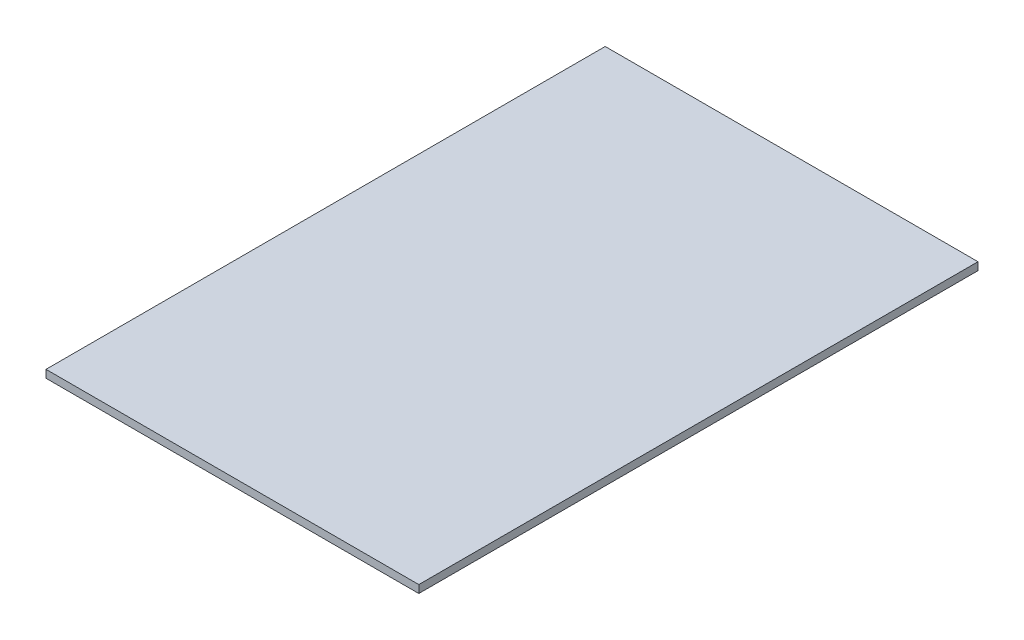
ISO-10303-21;
HEADER;
FILE_DESCRIPTION(('STEP AP214'),'2;1');
FILE_NAME('part.step','',(''),(''),'','','');
FILE_SCHEMA(('AUTOMOTIVE_DESIGN { 1 0 10303 214 1 1 1 1 }'));
ENDSEC;
DATA;
#1=APPLICATION_CONTEXT('core data for automotive mechanical design processes');
#2=APPLICATION_PROTOCOL_DEFINITION('international standard','automotive_design',2000,#1);
#3=PRODUCT_CONTEXT('',#1,'mechanical');
#4=PRODUCT('Part','Part','',(#3));
#5=PRODUCT_RELATED_PRODUCT_CATEGORY('part','',(#4));
#6=PRODUCT_DEFINITION_FORMATION('','',#4);
#7=PRODUCT_DEFINITION_CONTEXT('part definition',#1,'design');
#8=PRODUCT_DEFINITION('design','',#6,#7);
#9=PRODUCT_DEFINITION_SHAPE('','',#8);
#10=(LENGTH_UNIT() NAMED_UNIT(*) SI_UNIT(.MILLI.,.METRE.));
#11=(NAMED_UNIT(*) PLANE_ANGLE_UNIT() SI_UNIT($,.RADIAN.));
#12=(NAMED_UNIT(*) SI_UNIT($,.STERADIAN.) SOLID_ANGLE_UNIT());
#13=UNCERTAINTY_MEASURE_WITH_UNIT(LENGTH_MEASURE(1.E-05),#10,'distance_accuracy_value','');
#14=(GEOMETRIC_REPRESENTATION_CONTEXT(3) GLOBAL_UNCERTAINTY_ASSIGNED_CONTEXT((#13)) GLOBAL_UNIT_ASSIGNED_CONTEXT((#10,
#11,#12)) REPRESENTATION_CONTEXT('',''));
#15=CARTESIAN_POINT('',(0.,0.,0.));
#16=DIRECTION('',(0.,0.,1.));
#17=DIRECTION('',(1.,0.,0.));
#18=AXIS2_PLACEMENT_3D('',#15,#16,#17);
#19=CARTESIAN_POINT('',(304.8,6.34999999999986,457.200000000005));
#20=DIRECTION('',(-1.00000000000001,0.,0.));
#21=DIRECTION('',(0.,0.,1.00000000000001));
#22=AXIS2_PLACEMENT_3D('',#19,#20,#21);
#23=PLANE('',#22);
#24=DIRECTION('',(0.,0.,-1.00000000000001));
#25=VECTOR('',#24,1.);
#26=CARTESIAN_POINT('',(304.8,-6.34999999999986,457.200000000005));
#27=LINE('',#26,#25);
#28=CARTESIAN_POINT('',(304.8,-6.34999999999986,457.200000000005));
#29=VERTEX_POINT('',#28);
#30=CARTESIAN_POINT('',(304.8,-6.34999999999986,-457.200000000004));
#31=VERTEX_POINT('',#30);
#32=EDGE_CURVE('E122',#29,#31,#27,.T.);
#33=ORIENTED_EDGE('',*,*,#32,.T.);
#34=DIRECTION('',(0.,-1.,0.));
#35=VECTOR('',#34,1.);
#36=CARTESIAN_POINT('',(304.8,6.34999999999986,-457.200000000004));
#37=LINE('',#36,#35);
#38=CARTESIAN_POINT('',(304.8,6.34999999999986,-457.200000000004));
#39=VERTEX_POINT('',#38);
#40=EDGE_CURVE('E11',#39,#31,#37,.T.);
#41=ORIENTED_EDGE('',*,*,#40,.F.);
#42=DIRECTION('',(0.,0.,-1.00000000000001));
#43=VECTOR('',#42,1.);
#44=CARTESIAN_POINT('',(304.8,6.34999999999986,457.200000000005));
#45=LINE('',#44,#43);
#46=CARTESIAN_POINT('',(304.8,6.34999999999986,457.200000000005));
#47=VERTEX_POINT('',#46);
#48=EDGE_CURVE('E104',#47,#39,#45,.T.);
#49=ORIENTED_EDGE('',*,*,#48,.F.);
#50=DIRECTION('',(0.,-1.,0.));
#51=VECTOR('',#50,1.);
#52=CARTESIAN_POINT('',(304.8,6.34999999999986,457.200000000005));
#53=LINE('',#52,#51);
#54=EDGE_CURVE('E118',#47,#29,#53,.T.);
#55=ORIENTED_EDGE('',*,*,#54,.T.);
#56=EDGE_LOOP('',(#33,#41,#49,#55));
#57=FACE_BOUND('',#56,.T.);
#58=ADVANCED_FACE('F46',(#57),#23,.F.);
#59=CARTESIAN_POINT('',(-304.800000000005,6.34999999999986,-457.200000000006));
#60=DIRECTION('',(0.,0.,1.00000000000001));
#61=DIRECTION('',(1.00000000000001,0.,0.));
#62=AXIS2_PLACEMENT_3D('',#59,#60,#61);
#63=PLANE('',#62);
#64=DIRECTION('',(-1.00000000000001,0.,0.));
#65=VECTOR('',#64,1.);
#66=CARTESIAN_POINT('',(-304.800000000005,-6.34999999999986,-457.200000000006));
#67=LINE('',#66,#65);
#68=CARTESIAN_POINT('',(-304.800000000005,-6.34999999999986,-457.200000000006));
#69=VERTEX_POINT('',#68);
#70=EDGE_CURVE('E109',#31,#69,#67,.T.);
#71=ORIENTED_EDGE('',*,*,#70,.T.);
#72=DIRECTION('',(0.,-1.,0.));
#73=VECTOR('',#72,1.);
#74=CARTESIAN_POINT('',(-304.800000000005,6.34999999999986,-457.200000000006));
#75=LINE('',#74,#73);
#76=CARTESIAN_POINT('',(-304.800000000005,6.34999999999986,-457.200000000006));
#77=VERTEX_POINT('',#76);
#78=EDGE_CURVE('E55',#77,#69,#75,.T.);
#79=ORIENTED_EDGE('',*,*,#78,.F.);
#80=DIRECTION('',(-1.00000000000001,0.,0.));
#81=VECTOR('',#80,1.);
#82=CARTESIAN_POINT('',(-304.800000000005,6.34999999999986,-457.200000000006));
#83=LINE('',#82,#81);
#84=EDGE_CURVE('E99',#39,#77,#83,.T.);
#85=ORIENTED_EDGE('',*,*,#84,.F.);
#86=ORIENTED_EDGE('',*,*,#40,.T.);
#87=EDGE_LOOP('',(#71,#79,#85,#86));
#88=FACE_BOUND('',#87,.T.);
#89=ADVANCED_FACE('F108',(#88),#63,.F.);
#90=CARTESIAN_POINT('',(-304.800000000002,6.34999999999986,457.200000000004));
#91=DIRECTION('',(1.00000000000001,0.,0.));
#92=DIRECTION('',(0.,0.,-1.00000000000001));
#93=AXIS2_PLACEMENT_3D('',#90,#91,#92);
#94=PLANE('',#93);
#95=DIRECTION('',(0.,0.,1.00000000000001));
#96=VECTOR('',#95,1.);
#97=CARTESIAN_POINT('',(-304.800000000002,-6.34999999999986,457.200000000004));
#98=LINE('',#97,#96);
#99=CARTESIAN_POINT('',(-304.800000000002,-6.34999999999986,457.200000000004));
#100=VERTEX_POINT('',#99);
#101=EDGE_CURVE('E86',#69,#100,#98,.T.);
#102=ORIENTED_EDGE('',*,*,#101,.T.);
#103=DIRECTION('',(0.,-1.,0.));
#104=VECTOR('',#103,1.);
#105=CARTESIAN_POINT('',(-304.800000000002,6.34999999999986,457.200000000004));
#106=LINE('',#105,#104);
#107=CARTESIAN_POINT('',(-304.800000000002,6.34999999999986,457.200000000004));
#108=VERTEX_POINT('',#107);
#109=EDGE_CURVE('E111',#108,#100,#106,.T.);
#110=ORIENTED_EDGE('',*,*,#109,.F.);
#111=DIRECTION('',(0.,0.,1.00000000000001));
#112=VECTOR('',#111,1.);
#113=CARTESIAN_POINT('',(-304.800000000002,6.34999999999986,457.200000000004));
#114=LINE('',#113,#112);
#115=EDGE_CURVE('E102',#77,#108,#114,.T.);
#116=ORIENTED_EDGE('',*,*,#115,.F.);
#117=ORIENTED_EDGE('',*,*,#78,.T.);
#118=EDGE_LOOP('',(#102,#110,#116,#117));
#119=FACE_BOUND('',#118,.T.);
#120=ADVANCED_FACE('F112',(#119),#94,.F.);
#121=CARTESIAN_POINT('',(-304.800000000002,6.34999999999986,457.200000000004));
#122=DIRECTION('',(0.,0.,-1.00000000000001));
#123=DIRECTION('',(-1.00000000000001,0.,0.));
#124=AXIS2_PLACEMENT_3D('',#121,#122,#123);
#125=PLANE('',#124);
#126=DIRECTION('',(1.00000000000001,0.,0.));
#127=VECTOR('',#126,1.);
#128=CARTESIAN_POINT('',(-304.800000000002,-6.34999999999986,457.200000000004));
#129=LINE('',#128,#127);
#130=EDGE_CURVE('E92',#100,#29,#129,.T.);
#131=ORIENTED_EDGE('',*,*,#130,.T.);
#132=ORIENTED_EDGE('',*,*,#54,.F.);
#133=DIRECTION('',(1.00000000000001,0.,0.));
#134=VECTOR('',#133,1.);
#135=CARTESIAN_POINT('',(-304.800000000002,6.34999999999986,457.200000000004));
#136=LINE('',#135,#134);
#137=EDGE_CURVE('E65',#108,#47,#136,.T.);
#138=ORIENTED_EDGE('',*,*,#137,.F.);
#139=ORIENTED_EDGE('',*,*,#109,.T.);
#140=EDGE_LOOP('',(#131,#132,#138,#139));
#141=FACE_BOUND('',#140,.T.);
#142=ADVANCED_FACE('F137',(#141),#125,.F.);
#143=CARTESIAN_POINT('',(0.,6.34999999999986,0.));
#144=DIRECTION('',(0.,-1.,0.));
#145=DIRECTION('',(0.,0.,-1.00000000000001));
#146=AXIS2_PLACEMENT_3D('',#143,#144,#145);
#147=PLANE('',#146);
#148=ORIENTED_EDGE('',*,*,#48,.T.);
#149=ORIENTED_EDGE('',*,*,#84,.T.);
#150=ORIENTED_EDGE('',*,*,#115,.T.);
#151=ORIENTED_EDGE('',*,*,#137,.T.);
#152=EDGE_LOOP('',(#148,#149,#150,#151));
#153=FACE_BOUND('',#152,.T.);
#154=ADVANCED_FACE('F100',(#153),#147,.F.);
#155=CARTESIAN_POINT('',(0.,-6.34999999999986,0.));
#156=DIRECTION('',(0.,-1.,0.));
#157=DIRECTION('',(0.,0.,-1.00000000000001));
#158=AXIS2_PLACEMENT_3D('',#155,#156,#157);
#159=PLANE('',#158);
#160=ORIENTED_EDGE('',*,*,#32,.F.);
#161=ORIENTED_EDGE('',*,*,#130,.F.);
#162=ORIENTED_EDGE('',*,*,#101,.F.);
#163=ORIENTED_EDGE('',*,*,#70,.F.);
#164=EDGE_LOOP('',(#160,#161,#162,#163));
#165=FACE_BOUND('',#164,.T.);
#166=ADVANCED_FACE('F140',(#165),#159,.T.);
#167=CLOSED_SHELL('',(#58,#89,#120,#142,#154,#166));
#168=MANIFOLD_SOLID_BREP('B2',#167);
#169=ADVANCED_BREP_SHAPE_REPRESENTATION('',(#18,#168),#14);
#170=SHAPE_DEFINITION_REPRESENTATION(#9,#169);
ENDSEC;
END-ISO-10303-21;
